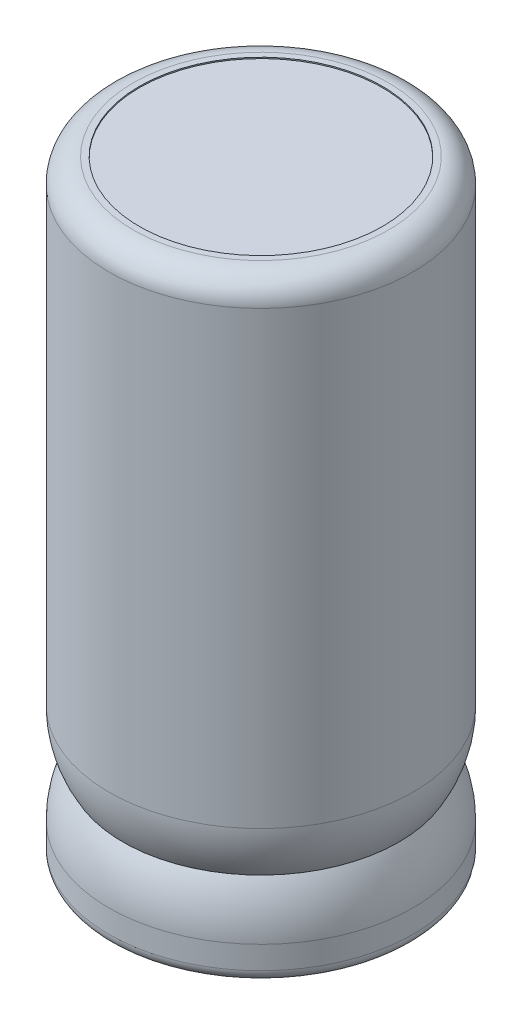
ISO-10303-21;
HEADER;
FILE_DESCRIPTION(('STEP AP214'),'2;1');
FILE_NAME('part.step','',(''),(''),'','','');
FILE_SCHEMA(('AUTOMOTIVE_DESIGN { 1 0 10303 214 1 1 1 1 }'));
ENDSEC;
DATA;
#1=APPLICATION_CONTEXT('core data for automotive mechanical design processes');
#2=APPLICATION_PROTOCOL_DEFINITION('international standard','automotive_design',2000,#1);
#3=PRODUCT_CONTEXT('',#1,'mechanical');
#4=PRODUCT('Part','Part','',(#3));
#5=PRODUCT_RELATED_PRODUCT_CATEGORY('part','',(#4));
#6=PRODUCT_DEFINITION_FORMATION('','',#4);
#7=PRODUCT_DEFINITION_CONTEXT('part definition',#1,'design');
#8=PRODUCT_DEFINITION('design','',#6,#7);
#9=PRODUCT_DEFINITION_SHAPE('','',#8);
#10=(LENGTH_UNIT() NAMED_UNIT(*) SI_UNIT(.MILLI.,.METRE.));
#11=(NAMED_UNIT(*) PLANE_ANGLE_UNIT() SI_UNIT($,.RADIAN.));
#12=(NAMED_UNIT(*) SI_UNIT($,.STERADIAN.) SOLID_ANGLE_UNIT());
#13=UNCERTAINTY_MEASURE_WITH_UNIT(LENGTH_MEASURE(1.E-05),#10,'distance_accuracy_value','');
#14=(GEOMETRIC_REPRESENTATION_CONTEXT(3) GLOBAL_UNCERTAINTY_ASSIGNED_CONTEXT((#13)) GLOBAL_UNIT_ASSIGNED_CONTEXT((#10,
#11,#12)) REPRESENTATION_CONTEXT('',''));
#15=CARTESIAN_POINT('',(0.,0.,0.));
#16=DIRECTION('',(0.,0.,1.));
#17=DIRECTION('',(1.,0.,0.));
#18=AXIS2_PLACEMENT_3D('',#15,#16,#17);
#19=CARTESIAN_POINT('',(-6.35,0.100000000000001,0.));
#20=DIRECTION('',(0.,1.,0.));
#21=DIRECTION('',(-1.,0.,0.));
#22=AXIS2_PLACEMENT_3D('',#19,#20,#21);
#23=PLANE('',#22);
#24=CARTESIAN_POINT('',(0.,0.100000000000002,0.));
#25=DIRECTION('',(0.,1.,0.));
#26=DIRECTION('',(-1.,0.,0.));
#27=AXIS2_PLACEMENT_3D('',#24,#25,#26);
#28=CIRCLE('',#27,0.5);
#29=CARTESIAN_POINT('',(-0.5,0.100000000000002,0.));
#30=VERTEX_POINT('',#29);
#31=EDGE_CURVE('E38',#30,#30,#28,.F.);
#32=ORIENTED_EDGE('',*,*,#31,.F.);
#33=EDGE_LOOP('',(#32));
#34=FACE_BOUND('',#33,.T.);
#35=CARTESIAN_POINT('',(-6.35,0.100000000000003,0.));
#36=DIRECTION('',(0.,1.,0.));
#37=DIRECTION('',(-1.,0.,0.));
#38=AXIS2_PLACEMENT_3D('',#35,#36,#37);
#39=CIRCLE('',#38,10.);
#40=CARTESIAN_POINT('',(-16.35,0.100000000000002,0.));
#41=VERTEX_POINT('',#40);
#42=EDGE_CURVE('E75',#41,#41,#39,.T.);
#43=ORIENTED_EDGE('',*,*,#42,.F.);
#44=EDGE_LOOP('',(#43));
#45=FACE_BOUND('',#44,.T.);
#46=CARTESIAN_POINT('',(-12.7,0.0999999999999998,0.));
#47=DIRECTION('',(0.,1.,0.));
#48=DIRECTION('',(-1.,0.,0.));
#49=AXIS2_PLACEMENT_3D('',#46,#47,#48);
#50=CIRCLE('',#49,0.500000000000001);
#51=CARTESIAN_POINT('',(-13.2,0.0999999999999998,0.));
#52=VERTEX_POINT('',#51);
#53=EDGE_CURVE('E10',#52,#52,#50,.F.);
#54=ORIENTED_EDGE('',*,*,#53,.F.);
#55=EDGE_LOOP('',(#54));
#56=FACE_BOUND('',#55,.T.);
#57=ADVANCED_FACE('F31',(#34,#45,#56),#23,.F.);
#58=CARTESIAN_POINT('',(-6.35000000000001,50.1,0.));
#59=DIRECTION('',(0.,-1.,0.));
#60=DIRECTION('',(1.,0.,0.));
#61=AXIS2_PLACEMENT_3D('',#58,#59,#60);
#62=PLANE('',#61);
#63=CARTESIAN_POINT('',(-6.35000000000001,50.1,0.));
#64=DIRECTION('',(0.,1.,0.));
#65=DIRECTION('',(-1.,0.,0.));
#66=AXIS2_PLACEMENT_3D('',#63,#64,#65);
#67=CIRCLE('',#66,10.);
#68=CARTESIAN_POINT('',(-16.35,50.1,0.));
#69=VERTEX_POINT('',#68);
#70=EDGE_CURVE('E42',#69,#69,#67,.T.);
#71=ORIENTED_EDGE('',*,*,#70,.T.);
#72=EDGE_LOOP('',(#71));
#73=FACE_BOUND('',#72,.T.);
#74=ADVANCED_FACE('F33',(#73),#62,.F.);
#75=CARTESIAN_POINT('',(-6.35000000000001,50.2,0.));
#76=DIRECTION('',(0.,1.,0.));
#77=DIRECTION('',(-1.,0.,0.));
#78=AXIS2_PLACEMENT_3D('',#75,#76,#77);
#79=CYLINDRICAL_SURFACE('',#78,10.);
#80=ORIENTED_EDGE('',*,*,#70,.F.);
#81=EDGE_LOOP('',(#80));
#82=FACE_BOUND('',#81,.T.);
#83=CARTESIAN_POINT('',(-6.35000000000001,50.2,0.));
#84=DIRECTION('',(0.,1.,0.));
#85=DIRECTION('',(-1.,0.,0.));
#86=AXIS2_PLACEMENT_3D('',#83,#84,#85);
#87=CIRCLE('',#86,10.);
#88=CARTESIAN_POINT('',(-16.35,50.2,0.));
#89=VERTEX_POINT('',#88);
#90=EDGE_CURVE('E46',#89,#89,#87,.T.);
#91=ORIENTED_EDGE('',*,*,#90,.T.);
#92=EDGE_LOOP('',(#91));
#93=FACE_BOUND('',#92,.T.);
#94=ADVANCED_FACE('F105',(#82,#93),#79,.F.);
#95=CARTESIAN_POINT('',(3.64999999999999,50.2,0.));
#96=DIRECTION('',(0.,-1.,0.));
#97=DIRECTION('',(1.,0.,0.));
#98=AXIS2_PLACEMENT_3D('',#95,#96,#97);
#99=PLANE('',#98);
#100=ORIENTED_EDGE('',*,*,#90,.F.);
#101=EDGE_LOOP('',(#100));
#102=FACE_BOUND('',#101,.T.);
#103=CARTESIAN_POINT('',(-6.35000000000001,50.2,0.));
#104=DIRECTION('',(0.,1.,0.));
#105=DIRECTION('',(-1.,0.,0.));
#106=AXIS2_PLACEMENT_3D('',#103,#104,#105);
#107=CIRCLE('',#106,10.5);
#108=CARTESIAN_POINT('',(-16.85,50.2,0.));
#109=VERTEX_POINT('',#108);
#110=EDGE_CURVE('E51',#109,#109,#107,.T.);
#111=ORIENTED_EDGE('',*,*,#110,.T.);
#112=EDGE_LOOP('',(#111));
#113=FACE_BOUND('',#112,.T.);
#114=ADVANCED_FACE('F141',(#102,#113),#99,.F.);
#115=CARTESIAN_POINT('',(-6.35000000000001,48.2,0.));
#116=DIRECTION('',(0.,1.,0.));
#117=DIRECTION('',(-1.,0.,0.));
#118=AXIS2_PLACEMENT_3D('',#115,#116,#117);
#119=TOROIDAL_SURFACE('',#118,10.5,2.);
#120=ORIENTED_EDGE('',*,*,#110,.F.);
#121=EDGE_LOOP('',(#120));
#122=FACE_BOUND('',#121,.T.);
#123=CARTESIAN_POINT('',(-6.35000000000001,48.2,0.));
#124=DIRECTION('',(0.,1.,0.));
#125=DIRECTION('',(-1.,0.,0.));
#126=AXIS2_PLACEMENT_3D('',#123,#124,#125);
#127=CIRCLE('',#126,12.5);
#128=CARTESIAN_POINT('',(-18.85,48.2,0.));
#129=VERTEX_POINT('',#128);
#130=EDGE_CURVE('E54',#129,#129,#127,.T.);
#131=ORIENTED_EDGE('',*,*,#130,.T.);
#132=EDGE_LOOP('',(#131));
#133=FACE_BOUND('',#132,.T.);
#134=ADVANCED_FACE('F137',(#122,#133),#119,.T.);
#135=CARTESIAN_POINT('',(-6.35000000000001,50.2,0.));
#136=DIRECTION('',(0.,1.,0.));
#137=DIRECTION('',(-1.,0.,0.));
#138=AXIS2_PLACEMENT_3D('',#135,#136,#137);
#139=CYLINDRICAL_SURFACE('',#138,12.5);
#140=ORIENTED_EDGE('',*,*,#130,.F.);
#141=EDGE_LOOP('',(#140));
#142=FACE_BOUND('',#141,.T.);
#143=CARTESIAN_POINT('',(-6.35,11.13,0.));
#144=DIRECTION('',(0.,1.,0.));
#145=DIRECTION('',(-1.,0.,0.));
#146=AXIS2_PLACEMENT_3D('',#143,#144,#145);
#147=CIRCLE('',#146,12.5);
#148=CARTESIAN_POINT('',(-18.85,11.13,0.));
#149=VERTEX_POINT('',#148);
#150=EDGE_CURVE('E57',#149,#149,#147,.T.);
#151=ORIENTED_EDGE('',*,*,#150,.T.);
#152=EDGE_LOOP('',(#151));
#153=FACE_BOUND('',#152,.T.);
#154=ADVANCED_FACE('F133',(#142,#153),#139,.T.);
#155=CARTESIAN_POINT('',(-6.35,11.13,0.));
#156=DIRECTION('',(0.,1.,0.));
#157=DIRECTION('',(-1.,0.,0.));
#158=AXIS2_PLACEMENT_3D('',#155,#156,#157);
#159=DEGENERATE_TOROIDAL_SURFACE('',#158,4.5,8.,.T.);
#160=ORIENTED_EDGE('',*,*,#150,.F.);
#161=EDGE_LOOP('',(#160));
#162=FACE_BOUND('',#161,.T.);
#163=CARTESIAN_POINT('',(-6.35,7.005,0.));
#164=DIRECTION('',(0.,1.,0.));
#165=DIRECTION('',(-1.,0.,0.));
#166=AXIS2_PLACEMENT_3D('',#163,#164,#165);
#167=CIRCLE('',#166,11.3545149354276);
#168=CARTESIAN_POINT('',(-17.7045149354276,7.005,0.));
#169=VERTEX_POINT('',#168);
#170=EDGE_CURVE('E60',#169,#169,#167,.T.);
#171=ORIENTED_EDGE('',*,*,#170,.T.);
#172=EDGE_LOOP('',(#171));
#173=FACE_BOUND('',#172,.T.);
#174=ADVANCED_FACE('F129',(#162,#173),#159,.T.);
#175=CARTESIAN_POINT('',(-6.35,2.88,0.));
#176=DIRECTION('',(0.,1.,0.));
#177=DIRECTION('',(-1.,0.,0.));
#178=AXIS2_PLACEMENT_3D('',#175,#176,#177);
#179=DEGENERATE_TOROIDAL_SURFACE('',#178,4.5,8.,.T.);
#180=ORIENTED_EDGE('',*,*,#170,.F.);
#181=EDGE_LOOP('',(#180));
#182=FACE_BOUND('',#181,.T.);
#183=CARTESIAN_POINT('',(-6.35,2.88,0.));
#184=DIRECTION('',(0.,1.,0.));
#185=DIRECTION('',(-1.,0.,0.));
#186=AXIS2_PLACEMENT_3D('',#183,#184,#185);
#187=CIRCLE('',#186,12.5);
#188=CARTESIAN_POINT('',(-18.85,2.88,0.));
#189=VERTEX_POINT('',#188);
#190=EDGE_CURVE('E63',#189,#189,#187,.T.);
#191=ORIENTED_EDGE('',*,*,#190,.T.);
#192=EDGE_LOOP('',(#191));
#193=FACE_BOUND('',#192,.T.);
#194=ADVANCED_FACE('F125',(#182,#193),#179,.T.);
#195=CARTESIAN_POINT('',(-6.35000000000001,50.2,0.));
#196=DIRECTION('',(0.,1.,0.));
#197=DIRECTION('',(-1.,0.,0.));
#198=AXIS2_PLACEMENT_3D('',#195,#196,#197);
#199=CYLINDRICAL_SURFACE('',#198,12.5);
#200=ORIENTED_EDGE('',*,*,#190,.F.);
#201=EDGE_LOOP('',(#200));
#202=FACE_BOUND('',#201,.T.);
#203=CARTESIAN_POINT('',(-6.35,1.,0.));
#204=DIRECTION('',(0.,1.,0.));
#205=DIRECTION('',(-1.,0.,0.));
#206=AXIS2_PLACEMENT_3D('',#203,#204,#205);
#207=CIRCLE('',#206,12.5);
#208=CARTESIAN_POINT('',(-18.85,0.999999999999999,0.));
#209=VERTEX_POINT('',#208);
#210=EDGE_CURVE('E66',#209,#209,#207,.T.);
#211=ORIENTED_EDGE('',*,*,#210,.T.);
#212=EDGE_LOOP('',(#211));
#213=FACE_BOUND('',#212,.T.);
#214=ADVANCED_FACE('F121',(#202,#213),#199,.T.);
#215=CARTESIAN_POINT('',(-6.35,1.,0.));
#216=DIRECTION('',(0.,1.,0.));
#217=DIRECTION('',(-1.,0.,0.));
#218=AXIS2_PLACEMENT_3D('',#215,#216,#217);
#219=TOROIDAL_SURFACE('',#218,11.5,1.);
#220=ORIENTED_EDGE('',*,*,#210,.F.);
#221=EDGE_LOOP('',(#220));
#222=FACE_BOUND('',#221,.T.);
#223=CARTESIAN_POINT('',(-6.35,0.,0.));
#224=DIRECTION('',(0.,1.,0.));
#225=DIRECTION('',(-1.,0.,0.));
#226=AXIS2_PLACEMENT_3D('',#223,#224,#225);
#227=CIRCLE('',#226,11.5);
#228=CARTESIAN_POINT('',(-17.85,0.,0.));
#229=VERTEX_POINT('',#228);
#230=EDGE_CURVE('E69',#229,#229,#227,.T.);
#231=ORIENTED_EDGE('',*,*,#230,.T.);
#232=EDGE_LOOP('',(#231));
#233=FACE_BOUND('',#232,.T.);
#234=ADVANCED_FACE('F117',(#222,#233),#219,.T.);
#235=CARTESIAN_POINT('',(3.65,0.,0.));
#236=DIRECTION('',(0.,1.,0.));
#237=DIRECTION('',(-1.,0.,0.));
#238=AXIS2_PLACEMENT_3D('',#235,#236,#237);
#239=PLANE('',#238);
#240=ORIENTED_EDGE('',*,*,#230,.F.);
#241=EDGE_LOOP('',(#240));
#242=FACE_BOUND('',#241,.T.);
#243=CARTESIAN_POINT('',(-6.35,0.,0.));
#244=DIRECTION('',(0.,1.,0.));
#245=DIRECTION('',(-1.,0.,0.));
#246=AXIS2_PLACEMENT_3D('',#243,#244,#245);
#247=CIRCLE('',#246,10.);
#248=CARTESIAN_POINT('',(-16.35,0.,0.));
#249=VERTEX_POINT('',#248);
#250=EDGE_CURVE('E72',#249,#249,#247,.T.);
#251=ORIENTED_EDGE('',*,*,#250,.T.);
#252=EDGE_LOOP('',(#251));
#253=FACE_BOUND('',#252,.T.);
#254=ADVANCED_FACE('F113',(#242,#253),#239,.F.);
#255=CARTESIAN_POINT('',(-6.35000000000001,50.2,0.));
#256=DIRECTION('',(0.,1.,0.));
#257=DIRECTION('',(-1.,0.,0.));
#258=AXIS2_PLACEMENT_3D('',#255,#256,#257);
#259=CYLINDRICAL_SURFACE('',#258,10.);
#260=ORIENTED_EDGE('',*,*,#250,.F.);
#261=EDGE_LOOP('',(#260));
#262=FACE_BOUND('',#261,.T.);
#263=ORIENTED_EDGE('',*,*,#42,.T.);
#264=EDGE_LOOP('',(#263));
#265=FACE_BOUND('',#264,.T.);
#266=ADVANCED_FACE('F110',(#262,#265),#259,.F.);
#267=CARTESIAN_POINT('',(0.,-3.4,0.));
#268=DIRECTION('',(0.,1.,0.));
#269=DIRECTION('',(-1.,0.,0.));
#270=AXIS2_PLACEMENT_3D('',#267,#268,#269);
#271=CYLINDRICAL_SURFACE('',#270,0.5);
#272=CARTESIAN_POINT('',(0.,-3.4,0.));
#273=DIRECTION('',(0.,-1.,0.));
#274=DIRECTION('',(1.,0.,0.));
#275=AXIS2_PLACEMENT_3D('',#272,#273,#274);
#276=CIRCLE('',#275,0.5);
#277=CARTESIAN_POINT('',(0.5,-3.4,0.));
#278=VERTEX_POINT('',#277);
#279=EDGE_CURVE('E78',#278,#278,#276,.T.);
#280=ORIENTED_EDGE('',*,*,#279,.F.);
#281=EDGE_LOOP('',(#280));
#282=FACE_BOUND('',#281,.T.);
#283=ORIENTED_EDGE('',*,*,#31,.T.);
#284=EDGE_LOOP('',(#283));
#285=FACE_BOUND('',#284,.T.);
#286=ADVANCED_FACE('F96',(#282,#285),#271,.T.);
#287=CARTESIAN_POINT('',(0.,-3.4,0.));
#288=DIRECTION('',(0.,-1.,0.));
#289=DIRECTION('',(1.,0.,0.));
#290=AXIS2_PLACEMENT_3D('',#287,#288,#289);
#291=PLANE('',#290);
#292=ORIENTED_EDGE('',*,*,#279,.T.);
#293=EDGE_LOOP('',(#292));
#294=FACE_BOUND('',#293,.T.);
#295=ADVANCED_FACE('F89',(#294),#291,.T.);
#296=CARTESIAN_POINT('',(-12.7,-3.4,0.));
#297=DIRECTION('',(0.,1.,0.));
#298=DIRECTION('',(-1.,0.,0.));
#299=AXIS2_PLACEMENT_3D('',#296,#297,#298);
#300=CYLINDRICAL_SURFACE('',#299,0.500000000000001);
#301=CARTESIAN_POINT('',(-12.7,-3.4,0.));
#302=DIRECTION('',(0.,-1.,0.));
#303=DIRECTION('',(1.,0.,0.));
#304=AXIS2_PLACEMENT_3D('',#301,#302,#303);
#305=CIRCLE('',#304,0.500000000000001);
#306=CARTESIAN_POINT('',(-12.2,-3.4,0.));
#307=VERTEX_POINT('',#306);
#308=EDGE_CURVE('E81',#307,#307,#305,.T.);
#309=ORIENTED_EDGE('',*,*,#308,.F.);
#310=EDGE_LOOP('',(#309));
#311=FACE_BOUND('',#310,.T.);
#312=ORIENTED_EDGE('',*,*,#53,.T.);
#313=EDGE_LOOP('',(#312));
#314=FACE_BOUND('',#313,.T.);
#315=ADVANCED_FACE('F87',(#311,#314),#300,.T.);
#316=CARTESIAN_POINT('',(-12.7,-3.4,0.));
#317=DIRECTION('',(0.,-1.,0.));
#318=DIRECTION('',(1.,0.,0.));
#319=AXIS2_PLACEMENT_3D('',#316,#317,#318);
#320=PLANE('',#319);
#321=ORIENTED_EDGE('',*,*,#308,.T.);
#322=EDGE_LOOP('',(#321));
#323=FACE_BOUND('',#322,.T.);
#324=ADVANCED_FACE('F85',(#323),#320,.T.);
#325=CLOSED_SHELL('',(#57,#74,#94,#114,#134,#154,#174,#194,#214,#234,#254,#266,#286,#295,#315,#324));
#326=MANIFOLD_SOLID_BREP('B2',#325);
#327=ADVANCED_BREP_SHAPE_REPRESENTATION('',(#18,#326),#14);
#328=SHAPE_DEFINITION_REPRESENTATION(#9,#327);
ENDSEC;
END-ISO-10303-21;
